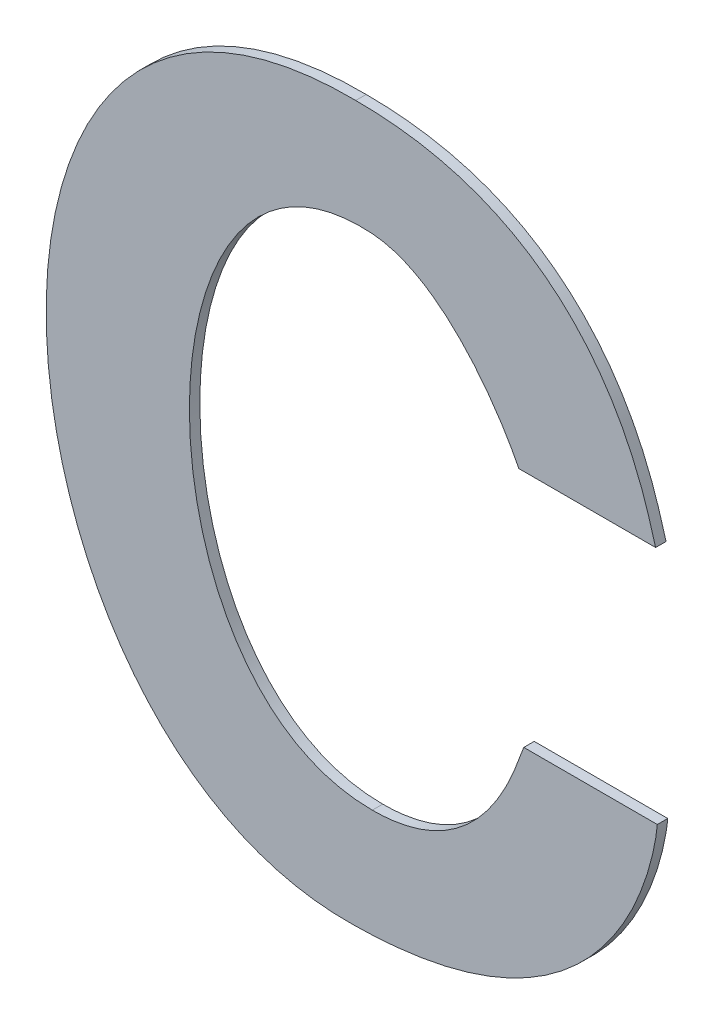
ISO-10303-21;
HEADER;
FILE_DESCRIPTION(('STEP AP214'),'2;1');
FILE_NAME('part.step','',(''),(''),'','','');
FILE_SCHEMA(('AUTOMOTIVE_DESIGN { 1 0 10303 214 1 1 1 1 }'));
ENDSEC;
DATA;
#1=APPLICATION_CONTEXT('core data for automotive mechanical design processes');
#2=APPLICATION_PROTOCOL_DEFINITION('international standard','automotive_design',2000,#1);
#3=PRODUCT_CONTEXT('',#1,'mechanical');
#4=PRODUCT('Part','Part','',(#3));
#5=PRODUCT_RELATED_PRODUCT_CATEGORY('part','',(#4));
#6=PRODUCT_DEFINITION_FORMATION('','',#4);
#7=PRODUCT_DEFINITION_CONTEXT('part definition',#1,'design');
#8=PRODUCT_DEFINITION('design','',#6,#7);
#9=PRODUCT_DEFINITION_SHAPE('','',#8);
#10=(LENGTH_UNIT() NAMED_UNIT(*) SI_UNIT(.MILLI.,.METRE.));
#11=(NAMED_UNIT(*) PLANE_ANGLE_UNIT() SI_UNIT($,.RADIAN.));
#12=(NAMED_UNIT(*) SI_UNIT($,.STERADIAN.) SOLID_ANGLE_UNIT());
#13=UNCERTAINTY_MEASURE_WITH_UNIT(LENGTH_MEASURE(1.E-05),#10,'distance_accuracy_value','');
#14=(GEOMETRIC_REPRESENTATION_CONTEXT(3) GLOBAL_UNCERTAINTY_ASSIGNED_CONTEXT((#13)) GLOBAL_UNIT_ASSIGNED_CONTEXT((#10,
#11,#12)) REPRESENTATION_CONTEXT('',''));
#15=CARTESIAN_POINT('',(0.,0.,0.));
#16=DIRECTION('',(0.,0.,1.));
#17=DIRECTION('',(1.,0.,0.));
#18=AXIS2_PLACEMENT_3D('',#15,#16,#17);
#19=CARTESIAN_POINT('',(3.530769903127,-0.925487186045347,0.));
#20=CARTESIAN_POINT('',(3.530769903127,-0.925487186045347,0.003));
#21=CARTESIAN_POINT('',(3.6133152925954,-0.92454749108111,0.));
#22=CARTESIAN_POINT('',(3.6133152925954,-0.92454749108111,0.003));
#23=CARTESIAN_POINT('',(3.6180800758916,-0.857162263177807,0.));
#24=CARTESIAN_POINT('',(3.6180800758916,-0.857162263177807,0.003));
#25=CARTESIAN_POINT('',(3.6180800758846,-0.856699046573255,0.));
#26=CARTESIAN_POINT('',(3.6180800758846,-0.856699046573255,0.003));
#27=B_SPLINE_SURFACE_WITH_KNOTS('',3,1,((#19,#20),(#21,#22),(#23,#24),(#25,#26)),.UNSPECIFIED.,
.F.,.F.,.F.,(4,4),(2,2),(0.,1.),(0.,0.0003),.UNSPECIFIED.);
#28=CARTESIAN_POINT('',(3.530769903127,-0.925487186045347,0.));
#29=CARTESIAN_POINT('',(3.6133152925954,-0.92454749108111,0.));
#30=CARTESIAN_POINT('',(3.6180800758916,-0.857162263177807,0.));
#31=CARTESIAN_POINT('',(3.6180800758846,-0.856699046573255,0.));
#32=B_SPLINE_CURVE_WITH_KNOTS('',3,(#28,#29,#30,#31),.UNSPECIFIED.,.F.,.F.,(4,4),(0.,1.),.UNSPECIFIED.);
#33=CARTESIAN_POINT('',(3.530769903127,-0.925487186045347,0.));
#34=VERTEX_POINT('',#33);
#35=CARTESIAN_POINT('',(3.6180800758846,-0.856699046573255,0.));
#36=VERTEX_POINT('',#35);
#37=EDGE_CURVE('E11',#34,#36,#32,.T.);
#38=DIRECTION('',(0.,0.,1.));
#39=VECTOR('',#38,1.);
#40=CARTESIAN_POINT('',(3.6180800758846,-0.856699046573255,0.));
#41=LINE('',#40,#39);
#42=CARTESIAN_POINT('',(3.6180800758846,-0.856699046573255,0.003));
#43=VERTEX_POINT('',#42);
#44=EDGE_CURVE('E27',#36,#43,#41,.T.);
#45=CARTESIAN_POINT('',(3.61808007588453,-0.856694230343661,0.003));
#46=CARTESIAN_POINT('',(3.61806200824694,-0.85694932814173,0.003));
#47=CARTESIAN_POINT('',(3.61804000437102,-0.857204062107889,0.003));
#48=CARTESIAN_POINT('',(3.61794303946116,-0.858179120006048,0.003));
#49=CARTESIAN_POINT('',(3.61784493146853,-0.858897111958526,0.003));
#50=CARTESIAN_POINT('',(3.61756265922982,-0.860734938216791,0.003));
#51=CARTESIAN_POINT('',(3.61736123191653,-0.86185195132666,0.003));
#52=CARTESIAN_POINT('',(3.61699073726386,-0.863652770499994,0.003));
#53=CARTESIAN_POINT('',(3.6168384202003,-0.864340032933863,0.003));
#54=CARTESIAN_POINT('',(3.61649594011614,-0.865790125429453,0.003));
#55=CARTESIAN_POINT('',(3.61630343451131,-0.866552401379594,0.003));
#56=CARTESIAN_POINT('',(3.61587583171299,-0.868144326701666,0.003));
#57=CARTESIAN_POINT('',(3.61563841535593,-0.868973353279531,0.003));
#58=CARTESIAN_POINT('',(3.61511649520128,-0.870690640746337,0.003));
#59=CARTESIAN_POINT('',(3.61482972984681,-0.871578214367869,0.003));
#60=CARTESIAN_POINT('',(3.6142045297359,-0.8734044427438,0.003));
#61=CARTESIAN_POINT('',(3.61386388608348,-0.87434234176615,0.003));
#62=CARTESIAN_POINT('',(3.61312636855905,-0.876261075877585,0.003));
#63=CARTESIAN_POINT('',(3.61272734136537,-0.877241083916698,0.003));
#64=CARTESIAN_POINT('',(3.61186848666735,-0.879235893310298,0.003));
#65=CARTESIAN_POINT('',(3.61140655908319,-0.880249791338314,0.003));
#66=CARTESIAN_POINT('',(3.61041733699016,-0.882304243694437,0.003));
#67=CARTESIAN_POINT('',(3.60988799059413,-0.883343811043574,0.003));
#68=CARTESIAN_POINT('',(3.60875936789741,-0.885441473165473,0.003));
#69=CARTESIAN_POINT('',(3.60815807875208,-0.886498486124065,0.003));
#70=CARTESIAN_POINT('',(3.60688101844376,-0.888622920633208,0.003));
#71=CARTESIAN_POINT('',(3.60620326033857,-0.889689148972682,0.003));
#72=CARTESIAN_POINT('',(3.60476871632594,-0.891823918599741,0.003));
#73=CARTESIAN_POINT('',(3.60400995208045,-0.892891132057434,0.003));
#74=CARTESIAN_POINT('',(3.60240889495216,-0.895019775006342,0.003));
#75=CARTESIAN_POINT('',(3.60156461354392,-0.896079709153095,0.003));
#76=CARTESIAN_POINT('',(3.59978793364879,-0.898185827059339,0.003));
#77=CARTESIAN_POINT('',(3.59885351220285,-0.899230309694721,0.003));
#78=CARTESIAN_POINT('',(3.59739507638256,-0.900767427595656,0.003));
#79=CARTESIAN_POINT('',(3.59689292884476,-0.901280982510835,0.003));
#80=CARTESIAN_POINT('',(3.59586469972533,-0.902301406511676,0.003));
#81=CARTESIAN_POINT('',(3.59533835596169,-0.902808012020179,0.003));
#82=CARTESIAN_POINT('',(3.59426119291679,-0.903813503592076,0.003));
#83=CARTESIAN_POINT('',(3.59371010779526,-0.904312104715662,0.003));
#84=CARTESIAN_POINT('',(3.59258289781147,-0.905300587564289,0.003));
#85=CARTESIAN_POINT('',(3.59200650297499,-0.905790161479443,0.003));
#86=CARTESIAN_POINT('',(3.59082811571271,-0.906759583256228,0.003));
#87=CARTESIAN_POINT('',(3.59022584941819,-0.9072390981912,0.003));
#88=CARTESIAN_POINT('',(3.58899515950667,-0.908187399781359,0.003));
#89=CARTESIAN_POINT('',(3.58836645845113,-0.908655826356393,0.003));
#90=CARTESIAN_POINT('',(3.58708233938394,-0.909580950348098,0.003));
#91=CARTESIAN_POINT('',(3.58642664097481,-0.91003725850401,0.003));
#92=CARTESIAN_POINT('',(3.58508796681094,-0.910937146887458,0.003));
#93=CARTESIAN_POINT('',(3.58440470855539,-0.911380306782822,0.003));
#94=CARTESIAN_POINT('',(3.58301035346628,-0.912252901617773,0.003));
#95=CARTESIAN_POINT('',(3.5822989731438,-0.912681883436611,0.003));
#96=CARTESIAN_POINT('',(3.58084781154648,-0.913525126706251,0.003));
#97=CARTESIAN_POINT('',(3.58010774715543,-0.913938900765971,0.003));
#98=CARTESIAN_POINT('',(3.57859865367611,-0.914750734457217,0.003));
#99=CARTESIAN_POINT('',(3.57782934343158,-0.915148271231516,0.003));
#100=CARTESIAN_POINT('',(3.5762611929091,-0.91592663735334,0.003));
#101=CARTESIAN_POINT('',(3.57546207521794,-0.916306907513498,0.003));
#102=CARTESIAN_POINT('',(3.57383374268471,-0.917049748131803,0.003));
#103=CARTESIAN_POINT('',(3.57300425611245,-0.917411722576405,0.003));
#104=CARTESIAN_POINT('',(3.57131461678922,-0.918116979839641,0.003));
#105=CARTESIAN_POINT('',(3.57045420004239,-0.918459629715584,0.003));
#106=CARTESIAN_POINT('',(3.56870212926687,-0.919125245886527,0.003));
#107=CARTESIAN_POINT('',(3.5678102210868,-0.919447542612778,0.003));
#108=CARTESIAN_POINT('',(3.56599459447354,-0.920071460063571,0.003));
#109=CARTESIAN_POINT('',(3.56507063385736,-0.920372375301182,0.003));
#110=CARTESIAN_POINT('',(3.56319032654898,-0.920952536627655,0.003));
#111=CARTESIAN_POINT('',(3.56223375169647,-0.92123104241539,0.003));
#112=CARTESIAN_POINT('',(3.5602876411237,-0.921765390065917,0.003));
#113=CARTESIAN_POINT('',(3.55929789332385,-0.92202045827202,0.003));
#114=CARTESIAN_POINT('',(3.557284848363,-0.92250693603281,0.003));
#115=CARTESIAN_POINT('',(3.55626135673259,-0.922737540420498,0.003));
#116=CARTESIAN_POINT('',(3.55418027963251,-0.923174087674863,0.003));
#117=CARTESIAN_POINT('',(3.55312252020077,-0.923379195788519,0.003));
#118=CARTESIAN_POINT('',(3.54985213884686,-0.923964082697212,0.003));
#119=CARTESIAN_POINT('',(3.54763012501107,-0.924292297149027,0.003));
#120=CARTESIAN_POINT('',(3.54304337261907,-0.924841524008571,0.003));
#121=CARTESIAN_POINT('',(3.54067779015242,-0.925055266340537,0.003));
#122=CARTESIAN_POINT('',(3.53579840755899,-0.925367458746028,0.003));
#123=CARTESIAN_POINT('',(3.53328411346108,-0.925458345104047,0.003));
#124=CARTESIAN_POINT('',(3.530769903127,-0.925487186045347,0.003));
#125=B_SPLINE_CURVE_WITH_KNOTS('',3,(#45,#46,#47,#48,#49,#50,#51,#52,#53,#54,#55,#56,#57,#58,
#59,#60,#61,#62,#63,#64,#65,#66,#67,#68,#69,#70,#71,#72,#73,#74,#75,#76,#77,#78,#79,#80,#81,#82,
#83,#84,#85,#86,#87,#88,#89,#90,#91,#92,#93,#94,#95,#96,#97,#98,#99,#100,#101,#102,#103,#104,
#105,#106,#107,#108,#109,#110,#111,#112,#113,#114,#115,#116,#117,#118,#119,#120,#121,#122,#123,
#124),.UNSPECIFIED.,.F.,.F.,(4,2,2,2,2,2,2,2,2,2,2,2,2,2,2,2,2,2,2,2,2,2,2,2,2,2,2,2,2,2,2,2,2,
2,2,2,2,2,2,4),(0.,0.000767024470525558,0.00293980908473139,0.00634371522522884,
0.00845523833023619,0.010813501869872,0.0134000991963652,0.0161977854420306,0.0191906310690332,
0.0223641927824391,0.025705701699146,0.0292042675865279,0.0328510964856244,0.0366397170816027,
0.0405662088157952,0.044629422098682,0.0488311783861105,0.0509856768707903,0.0531769355526741,
0.0554060831700064,0.0576744554509728,0.0599835950166957,0.0623352500262232,0.064731371525948,
0.0671741094945762,0.0696658076054803,0.0722089967598455,0.0748063874747788,0.0774608612389393,
0.0801754609729121,0.0829533807510809,0.0857979549553803,0.0887126470384789,0.0917010380745122,
0.0947668152699667,0.097913760596182,0.10114573968943,0.107879913017995,0.115002267322604,
0.122545724118345),.UNSPECIFIED.);
#126=CARTESIAN_POINT('',(3.530769903127,-0.925487186045347,0.003));
#127=VERTEX_POINT('',#126);
#128=EDGE_CURVE('E104',#127,#43,#125,.F.);
#129=DIRECTION('',(0.,0.,1.));
#130=VECTOR('',#129,1.);
#131=CARTESIAN_POINT('',(3.530769903127,-0.925487186045347,0.));
#132=LINE('',#131,#130);
#133=EDGE_CURVE('E209',#34,#127,#132,.T.);
#134=ORIENTED_EDGE('',*,*,#37,.T.);
#135=ORIENTED_EDGE('',*,*,#44,.T.);
#136=ORIENTED_EDGE('',*,*,#128,.F.);
#137=ORIENTED_EDGE('',*,*,#133,.F.);
#138=EDGE_LOOP('',(#134,#135,#136,#137));
#139=FACE_BOUND('',#138,.T.);
#140=ADVANCED_FACE('F17',(#139),#27,.T.);
#141=CARTESIAN_POINT('',(3.5312340670053,-0.719548093305039,0.));
#142=CARTESIAN_POINT('',(3.5312340670053,-0.719548093305039,0.003));
#143=CARTESIAN_POINT('',(3.4031058911651,-0.718127183473972,0.));
#144=CARTESIAN_POINT('',(3.4031058911651,-0.718127183473972,0.003));
#145=CARTESIAN_POINT('',(3.4221176647052,-0.92787052546857,0.));
#146=CARTESIAN_POINT('',(3.4221176647052,-0.92787052546857,0.003));
#147=CARTESIAN_POINT('',(3.530769903127,-0.925487186045347,0.));
#148=CARTESIAN_POINT('',(3.530769903127,-0.925487186045347,0.003));
#149=B_SPLINE_SURFACE_WITH_KNOTS('',3,1,((#141,#142),(#143,#144),(#145,#146),(#147,#148)),
.UNSPECIFIED.,.F.,.F.,.F.,(4,4),(2,2),(0.,1.),(0.,0.0003),.UNSPECIFIED.);
#150=CARTESIAN_POINT('',(3.5312340670053,-0.719548093305039,0.));
#151=CARTESIAN_POINT('',(3.4031058911651,-0.718127183473972,0.));
#152=CARTESIAN_POINT('',(3.4221176647052,-0.92787052546857,0.));
#153=CARTESIAN_POINT('',(3.530769903127,-0.925487186045347,0.));
#154=B_SPLINE_CURVE_WITH_KNOTS('',3,(#150,#151,#152,#153),.UNSPECIFIED.,.F.,.F.,(4,4),(0.,1.),.UNSPECIFIED.);
#155=CARTESIAN_POINT('',(3.5312340670053,-0.719548093305039,0.));
#156=VERTEX_POINT('',#155);
#157=EDGE_CURVE('E199',#156,#34,#154,.T.);
#158=CARTESIAN_POINT('',(3.5312340670053,-0.719548093305039,0.003));
#159=CARTESIAN_POINT('',(3.4031058911651,-0.718127183473972,0.003));
#160=CARTESIAN_POINT('',(3.4221176647052,-0.92787052546857,0.003));
#161=CARTESIAN_POINT('',(3.530769903127,-0.925487186045347,0.003));
#162=B_SPLINE_CURVE_WITH_KNOTS('',3,(#158,#159,#160,#161),.UNSPECIFIED.,.F.,.F.,(4,4),(0.,1.),.UNSPECIFIED.);
#163=CARTESIAN_POINT('',(3.5312340670053,-0.719548093305039,0.003));
#164=VERTEX_POINT('',#163);
#165=EDGE_CURVE('E190',#164,#127,#162,.T.);
#166=DIRECTION('',(0.,0.,1.));
#167=VECTOR('',#166,1.);
#168=CARTESIAN_POINT('',(3.5312340670053,-0.719548093305039,0.));
#169=LINE('',#168,#167);
#170=EDGE_CURVE('E184',#156,#164,#169,.T.);
#171=ORIENTED_EDGE('',*,*,#157,.T.);
#172=ORIENTED_EDGE('',*,*,#133,.T.);
#173=ORIENTED_EDGE('',*,*,#165,.F.);
#174=ORIENTED_EDGE('',*,*,#170,.F.);
#175=EDGE_LOOP('',(#171,#172,#173,#174));
#176=FACE_BOUND('',#175,.T.);
#177=ADVANCED_FACE('F279',(#176),#149,.T.);
#178=CARTESIAN_POINT('',(3.6175969665422,-0.787873963445503,0.));
#179=CARTESIAN_POINT('',(3.6175969665422,-0.787873963445503,0.003));
#180=CARTESIAN_POINT('',(3.6147551901895,-0.778863439586125,0.));
#181=CARTESIAN_POINT('',(3.6147551901895,-0.778863439586125,0.003));
#182=CARTESIAN_POINT('',(3.6024216495453,-0.719548041326987,0.));
#183=CARTESIAN_POINT('',(3.6024216495453,-0.719548041326987,0.003));
#184=CARTESIAN_POINT('',(3.5312340670053,-0.719548093305039,0.));
#185=CARTESIAN_POINT('',(3.5312340670053,-0.719548093305039,0.003));
#186=B_SPLINE_SURFACE_WITH_KNOTS('',3,1,((#178,#179),(#180,#181),(#182,#183),(#184,#185)),
.UNSPECIFIED.,.F.,.F.,.F.,(4,4),(2,2),(0.,1.),(0.,0.0003),.UNSPECIFIED.);
#187=CARTESIAN_POINT('',(3.6175969665422,-0.787873963445503,0.));
#188=CARTESIAN_POINT('',(3.6147551901895,-0.778863439586125,0.));
#189=CARTESIAN_POINT('',(3.6024216495453,-0.719548041326987,0.));
#190=CARTESIAN_POINT('',(3.5312340670053,-0.719548093305039,0.));
#191=B_SPLINE_CURVE_WITH_KNOTS('',3,(#187,#188,#189,#190),.UNSPECIFIED.,.F.,.F.,(4,4),(0.,1.),.UNSPECIFIED.);
#192=CARTESIAN_POINT('',(3.6175969665422,-0.787873963445503,0.));
#193=VERTEX_POINT('',#192);
#194=EDGE_CURVE('E176',#193,#156,#191,.T.);
#195=CARTESIAN_POINT('',(3.6175969665422,-0.787873963445503,0.003));
#196=CARTESIAN_POINT('',(3.6147551901895,-0.778863439586125,0.003));
#197=CARTESIAN_POINT('',(3.6024216495453,-0.719548041326987,0.003));
#198=CARTESIAN_POINT('',(3.5312340670053,-0.719548093305039,0.003));
#199=B_SPLINE_CURVE_WITH_KNOTS('',3,(#195,#196,#197,#198),.UNSPECIFIED.,.F.,.F.,(4,4),(0.,1.),.UNSPECIFIED.);
#200=CARTESIAN_POINT('',(3.6175969665422,-0.787873963445503,0.003));
#201=VERTEX_POINT('',#200);
#202=EDGE_CURVE('E171',#201,#164,#199,.T.);
#203=DIRECTION('',(0.,0.,1.));
#204=VECTOR('',#203,1.);
#205=CARTESIAN_POINT('',(3.6175969665422,-0.787873963445503,0.));
#206=LINE('',#205,#204);
#207=EDGE_CURVE('E168',#193,#201,#206,.T.);
#208=ORIENTED_EDGE('',*,*,#194,.T.);
#209=ORIENTED_EDGE('',*,*,#170,.T.);
#210=ORIENTED_EDGE('',*,*,#202,.F.);
#211=ORIENTED_EDGE('',*,*,#207,.F.);
#212=EDGE_LOOP('',(#208,#209,#210,#211));
#213=FACE_BOUND('',#212,.T.);
#214=ADVANCED_FACE('F274',(#213),#186,.T.);
#215=CARTESIAN_POINT('',(3.5782093460226,-0.787873963445503,0.));
#216=DIRECTION('',(0.,-1.,0.));
#217=DIRECTION('',(1.,0.,0.));
#218=AXIS2_PLACEMENT_3D('',#215,#216,#217);
#219=PLANE('',#218);
#220=DIRECTION('',(1.,0.,0.));
#221=VECTOR('',#220,1.);
#222=CARTESIAN_POINT('',(3.5782093460226,-0.787873963445503,0.));
#223=LINE('',#222,#221);
#224=CARTESIAN_POINT('',(3.5782093460226,-0.787873963445503,0.));
#225=VERTEX_POINT('',#224);
#226=EDGE_CURVE('E165',#225,#193,#223,.T.);
#227=ORIENTED_EDGE('',*,*,#226,.T.);
#228=ORIENTED_EDGE('',*,*,#207,.T.);
#229=DIRECTION('',(1.,0.,0.));
#230=VECTOR('',#229,1.);
#231=CARTESIAN_POINT('',(3.5782093460226,-0.787873963445503,0.003));
#232=LINE('',#231,#230);
#233=CARTESIAN_POINT('',(3.5782093460226,-0.787873963445503,0.003));
#234=VERTEX_POINT('',#233);
#235=EDGE_CURVE('E162',#234,#201,#232,.T.);
#236=ORIENTED_EDGE('',*,*,#235,.F.);
#237=DIRECTION('',(0.,0.,1.));
#238=VECTOR('',#237,1.);
#239=CARTESIAN_POINT('',(3.5782093460226,-0.787873963445503,0.));
#240=LINE('',#239,#238);
#241=EDGE_CURVE('E156',#225,#234,#240,.T.);
#242=ORIENTED_EDGE('',*,*,#241,.F.);
#243=EDGE_LOOP('',(#227,#228,#236,#242));
#244=FACE_BOUND('',#243,.T.);
#245=ADVANCED_FACE('F265',(#244),#219,.T.);
#246=CARTESIAN_POINT('',(3.5359988513054,-0.750386573006968,0.));
#247=CARTESIAN_POINT('',(3.5359988513054,-0.750386573006968,0.003));
#248=CARTESIAN_POINT('',(3.5559010460976,-0.7518292797622,0.));
#249=CARTESIAN_POINT('',(3.5559010460976,-0.7518292797622,0.003));
#250=CARTESIAN_POINT('',(3.572042592034,-0.775559414240294,0.));
#251=CARTESIAN_POINT('',(3.572042592034,-0.775559414240294,0.003));
#252=CARTESIAN_POINT('',(3.5782093460226,-0.787873963445503,0.));
#253=CARTESIAN_POINT('',(3.5782093460226,-0.787873963445503,0.003));
#254=B_SPLINE_SURFACE_WITH_KNOTS('',3,1,((#246,#247),(#248,#249),(#250,#251),(#252,#253)),
.UNSPECIFIED.,.F.,.F.,.F.,(4,4),(2,2),(0.,1.),(0.,0.0003),.UNSPECIFIED.);
#255=CARTESIAN_POINT('',(3.5359988513054,-0.750386573006968,0.));
#256=CARTESIAN_POINT('',(3.5559010460976,-0.7518292797622,0.));
#257=CARTESIAN_POINT('',(3.572042592034,-0.775559414240294,0.));
#258=CARTESIAN_POINT('',(3.5782093460226,-0.787873963445503,0.));
#259=B_SPLINE_CURVE_WITH_KNOTS('',3,(#255,#256,#257,#258),.UNSPECIFIED.,.F.,.F.,(4,4),(0.,1.),.UNSPECIFIED.);
#260=CARTESIAN_POINT('',(3.5359988513054,-0.750386573006968,0.));
#261=VERTEX_POINT('',#260);
#262=EDGE_CURVE('E148',#261,#225,#259,.T.);
#263=CARTESIAN_POINT('',(3.5359988513054,-0.750386573006968,0.003));
#264=CARTESIAN_POINT('',(3.5559010460976,-0.7518292797622,0.003));
#265=CARTESIAN_POINT('',(3.572042592034,-0.775559414240294,0.003));
#266=CARTESIAN_POINT('',(3.5782093460226,-0.787873963445503,0.003));
#267=B_SPLINE_CURVE_WITH_KNOTS('',3,(#263,#264,#265,#266),.UNSPECIFIED.,.F.,.F.,(4,4),(0.,1.),.UNSPECIFIED.);
#268=CARTESIAN_POINT('',(3.5359988513054,-0.750386573006968,0.003));
#269=VERTEX_POINT('',#268);
#270=EDGE_CURVE('E143',#269,#234,#267,.T.);
#271=DIRECTION('',(0.,0.,1.));
#272=VECTOR('',#271,1.);
#273=CARTESIAN_POINT('',(3.5359988513054,-0.750386573006968,0.));
#274=LINE('',#273,#272);
#275=EDGE_CURVE('E137',#261,#269,#274,.T.);
#276=ORIENTED_EDGE('',*,*,#262,.T.);
#277=ORIENTED_EDGE('',*,*,#241,.T.);
#278=ORIENTED_EDGE('',*,*,#270,.F.);
#279=ORIENTED_EDGE('',*,*,#275,.F.);
#280=EDGE_LOOP('',(#276,#277,#278,#279));
#281=FACE_BOUND('',#280,.T.);
#282=ADVANCED_FACE('F254',(#281),#254,.T.);
#283=CARTESIAN_POINT('',(3.5359988513054,-0.894168438820587,0.));
#284=CARTESIAN_POINT('',(3.5359988513054,-0.894168438820587,0.003));
#285=CARTESIAN_POINT('',(3.4657680147183,-0.894168438820525,0.));
#286=CARTESIAN_POINT('',(3.4657680147183,-0.894168438820525,0.003));
#287=CARTESIAN_POINT('',(3.4657680147183,-0.745660626908495,0.));
#288=CARTESIAN_POINT('',(3.4657680147183,-0.745660626908495,0.003));
#289=CARTESIAN_POINT('',(3.5359988513054,-0.750386573006968,0.));
#290=CARTESIAN_POINT('',(3.5359988513054,-0.750386573006968,0.003));
#291=B_SPLINE_SURFACE_WITH_KNOTS('',3,1,((#283,#284),(#285,#286),(#287,#288),(#289,#290)),
.UNSPECIFIED.,.F.,.F.,.F.,(4,4),(2,2),(0.,1.),(0.,0.0003),.UNSPECIFIED.);
#292=CARTESIAN_POINT('',(3.5359988513054,-0.894168438820587,0.));
#293=CARTESIAN_POINT('',(3.4657680147183,-0.894168438820525,0.));
#294=CARTESIAN_POINT('',(3.4657680147183,-0.745660626908495,0.));
#295=CARTESIAN_POINT('',(3.5359988513054,-0.750386573006968,0.));
#296=B_SPLINE_CURVE_WITH_KNOTS('',3,(#292,#293,#294,#295),.UNSPECIFIED.,.F.,.F.,(4,4),(0.,1.),.UNSPECIFIED.);
#297=CARTESIAN_POINT('',(3.5359988513054,-0.894168438820587,0.));
#298=VERTEX_POINT('',#297);
#299=EDGE_CURVE('E129',#298,#261,#296,.T.);
#300=CARTESIAN_POINT('',(3.5359988513054,-0.894168438820587,0.003));
#301=CARTESIAN_POINT('',(3.4657680147183,-0.894168438820525,0.003));
#302=CARTESIAN_POINT('',(3.4657680147183,-0.745660626908495,0.003));
#303=CARTESIAN_POINT('',(3.5359988513054,-0.750386573006968,0.003));
#304=B_SPLINE_CURVE_WITH_KNOTS('',3,(#300,#301,#302,#303),.UNSPECIFIED.,.F.,.F.,(4,4),(0.,1.),.UNSPECIFIED.);
#305=CARTESIAN_POINT('',(3.5359988513054,-0.894168438820587,0.003));
#306=VERTEX_POINT('',#305);
#307=EDGE_CURVE('E125',#306,#269,#304,.T.);
#308=DIRECTION('',(0.,0.,1.));
#309=VECTOR('',#308,1.);
#310=CARTESIAN_POINT('',(3.5359988513054,-0.894168438820587,0.));
#311=LINE('',#310,#309);
#312=EDGE_CURVE('E89',#298,#306,#311,.T.);
#313=ORIENTED_EDGE('',*,*,#299,.T.);
#314=ORIENTED_EDGE('',*,*,#275,.T.);
#315=ORIENTED_EDGE('',*,*,#307,.F.);
#316=ORIENTED_EDGE('',*,*,#312,.F.);
#317=EDGE_LOOP('',(#313,#314,#315,#316));
#318=FACE_BOUND('',#317,.T.);
#319=ADVANCED_FACE('F244',(#318),#291,.T.);
#320=CARTESIAN_POINT('',(3.5796302558539,-0.856699046573255,0.));
#321=CARTESIAN_POINT('',(3.5796302558539,-0.856699046573255,0.003));
#322=CARTESIAN_POINT('',(3.5777546548768,-0.860484350363084,0.));
#323=CARTESIAN_POINT('',(3.5777546548768,-0.860484350363084,0.003));
#324=CARTESIAN_POINT('',(3.5696838870362,-0.894168438820525,0.));
#325=CARTESIAN_POINT('',(3.5696838870362,-0.894168438820525,0.003));
#326=CARTESIAN_POINT('',(3.5359988513054,-0.894168438820587,0.));
#327=CARTESIAN_POINT('',(3.5359988513054,-0.894168438820587,0.003));
#328=B_SPLINE_SURFACE_WITH_KNOTS('',3,1,((#320,#321),(#322,#323),(#324,#325),(#326,#327)),
.UNSPECIFIED.,.F.,.F.,.F.,(4,4),(2,2),(0.,1.),(0.,0.0003),.UNSPECIFIED.);
#329=CARTESIAN_POINT('',(3.5796302558539,-0.856699046573255,0.));
#330=CARTESIAN_POINT('',(3.5777546548768,-0.860484350363084,0.));
#331=CARTESIAN_POINT('',(3.5696838870362,-0.894168438820525,0.));
#332=CARTESIAN_POINT('',(3.5359988513054,-0.894168438820587,0.));
#333=B_SPLINE_CURVE_WITH_KNOTS('',3,(#329,#330,#331,#332),.UNSPECIFIED.,.F.,.F.,(4,4),(0.,1.),.UNSPECIFIED.);
#334=CARTESIAN_POINT('',(3.5796302558539,-0.856699046573255,0.));
#335=VERTEX_POINT('',#334);
#336=EDGE_CURVE('E93',#335,#298,#333,.T.);
#337=CARTESIAN_POINT('',(3.5796302558539,-0.856699046573255,0.003));
#338=CARTESIAN_POINT('',(3.5777546548768,-0.860484350363084,0.003));
#339=CARTESIAN_POINT('',(3.5696838870362,-0.894168438820525,0.003));
#340=CARTESIAN_POINT('',(3.5359988513054,-0.894168438820587,0.003));
#341=B_SPLINE_CURVE_WITH_KNOTS('',3,(#337,#338,#339,#340),.UNSPECIFIED.,.F.,.F.,(4,4),(0.,1.),.UNSPECIFIED.);
#342=CARTESIAN_POINT('',(3.5796302558539,-0.856699046573255,0.003));
#343=VERTEX_POINT('',#342);
#344=EDGE_CURVE('E82',#343,#306,#341,.T.);
#345=DIRECTION('',(0.,0.,1.));
#346=VECTOR('',#345,1.);
#347=CARTESIAN_POINT('',(3.5796302558539,-0.856699046573255,0.));
#348=LINE('',#347,#346);
#349=EDGE_CURVE('E86',#335,#343,#348,.T.);
#350=ORIENTED_EDGE('',*,*,#336,.T.);
#351=ORIENTED_EDGE('',*,*,#312,.T.);
#352=ORIENTED_EDGE('',*,*,#344,.F.);
#353=ORIENTED_EDGE('',*,*,#349,.F.);
#354=EDGE_LOOP('',(#350,#351,#352,#353));
#355=FACE_BOUND('',#354,.T.);
#356=ADVANCED_FACE('F85',(#355),#328,.T.);
#357=CARTESIAN_POINT('',(3.6180800758846,-0.856699046573255,0.));
#358=DIRECTION('',(0.,1.,0.));
#359=DIRECTION('',(-1.,0.,0.));
#360=AXIS2_PLACEMENT_3D('',#357,#358,#359);
#361=PLANE('',#360);
#362=DIRECTION('',(-1.,0.,0.));
#363=VECTOR('',#362,1.);
#364=CARTESIAN_POINT('',(3.6180800758846,-0.856699046573255,0.));
#365=LINE('',#364,#363);
#366=EDGE_CURVE('E99',#36,#335,#365,.T.);
#367=ORIENTED_EDGE('',*,*,#366,.T.);
#368=ORIENTED_EDGE('',*,*,#349,.T.);
#369=DIRECTION('',(-1.,0.,0.));
#370=VECTOR('',#369,1.);
#371=CARTESIAN_POINT('',(3.6180800758846,-0.856699046573255,0.003));
#372=LINE('',#371,#370);
#373=EDGE_CURVE('E98',#43,#343,#372,.T.);
#374=ORIENTED_EDGE('',*,*,#373,.F.);
#375=ORIENTED_EDGE('',*,*,#44,.F.);
#376=EDGE_LOOP('',(#367,#368,#374,#375));
#377=FACE_BOUND('',#376,.T.);
#378=ADVANCED_FACE('F97',(#377),#361,.T.);
#379=CARTESIAN_POINT('',(3.5105929835283,-0.822998854471271,0.003));
#380=DIRECTION('',(0.,0.,1.));
#381=DIRECTION('',(1.,0.,0.));
#382=AXIS2_PLACEMENT_3D('',#379,#380,#381);
#383=PLANE('',#382);
#384=ORIENTED_EDGE('',*,*,#373,.T.);
#385=ORIENTED_EDGE('',*,*,#344,.T.);
#386=ORIENTED_EDGE('',*,*,#307,.T.);
#387=ORIENTED_EDGE('',*,*,#270,.T.);
#388=ORIENTED_EDGE('',*,*,#235,.T.);
#389=ORIENTED_EDGE('',*,*,#202,.T.);
#390=ORIENTED_EDGE('',*,*,#165,.T.);
#391=ORIENTED_EDGE('',*,*,#128,.T.);
#392=EDGE_LOOP('',(#384,#385,#386,#387,#388,#389,#390,#391));
#393=FACE_BOUND('',#392,.T.);
#394=ADVANCED_FACE('F102',(#393),#383,.T.);
#395=CARTESIAN_POINT('',(3.5105929835283,-0.822998854471271,0.));
#396=DIRECTION('',(0.,0.,1.));
#397=DIRECTION('',(1.,0.,0.));
#398=AXIS2_PLACEMENT_3D('',#395,#396,#397);
#399=PLANE('',#398);
#400=ORIENTED_EDGE('',*,*,#366,.F.);
#401=ORIENTED_EDGE('',*,*,#37,.F.);
#402=ORIENTED_EDGE('',*,*,#157,.F.);
#403=ORIENTED_EDGE('',*,*,#194,.F.);
#404=ORIENTED_EDGE('',*,*,#226,.F.);
#405=ORIENTED_EDGE('',*,*,#262,.F.);
#406=ORIENTED_EDGE('',*,*,#299,.F.);
#407=ORIENTED_EDGE('',*,*,#336,.F.);
#408=EDGE_LOOP('',(#400,#401,#402,#403,#404,#405,#406,#407));
#409=FACE_BOUND('',#408,.T.);
#410=ADVANCED_FACE('F236',(#409),#399,.F.);
#411=CLOSED_SHELL('',(#140,#177,#214,#245,#282,#319,#356,#378,#394,#410));
#412=MANIFOLD_SOLID_BREP('B1',#411);
#413=ADVANCED_BREP_SHAPE_REPRESENTATION('',(#18,#412),#14);
#414=SHAPE_DEFINITION_REPRESENTATION(#9,#413);
ENDSEC;
END-ISO-10303-21;
